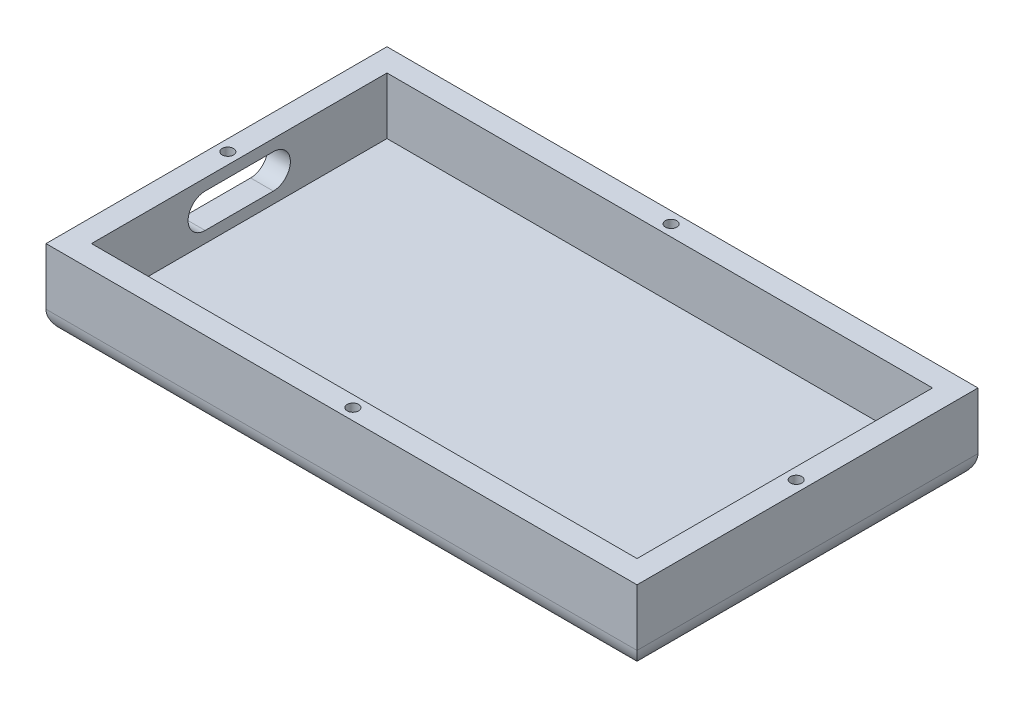
ISO-10303-21;
HEADER;
FILE_DESCRIPTION(('STEP AP214'),'2;1');
FILE_NAME('part.step','',(''),(''),'','','');
FILE_SCHEMA(('AUTOMOTIVE_DESIGN { 1 0 10303 214 1 1 1 1 }'));
ENDSEC;
DATA;
#1=APPLICATION_CONTEXT('core data for automotive mechanical design processes');
#2=APPLICATION_PROTOCOL_DEFINITION('international standard','automotive_design',2000,#1);
#3=PRODUCT_CONTEXT('',#1,'mechanical');
#4=PRODUCT('Part','Part','',(#3));
#5=PRODUCT_RELATED_PRODUCT_CATEGORY('part','',(#4));
#6=PRODUCT_DEFINITION_FORMATION('','',#4);
#7=PRODUCT_DEFINITION_CONTEXT('part definition',#1,'design');
#8=PRODUCT_DEFINITION('design','',#6,#7);
#9=PRODUCT_DEFINITION_SHAPE('','',#8);
#10=(LENGTH_UNIT() NAMED_UNIT(*) SI_UNIT(.MILLI.,.METRE.));
#11=(NAMED_UNIT(*) PLANE_ANGLE_UNIT() SI_UNIT($,.RADIAN.));
#12=(NAMED_UNIT(*) SI_UNIT($,.STERADIAN.) SOLID_ANGLE_UNIT());
#13=UNCERTAINTY_MEASURE_WITH_UNIT(LENGTH_MEASURE(1.E-05),#10,'distance_accuracy_value','');
#14=(GEOMETRIC_REPRESENTATION_CONTEXT(3) GLOBAL_UNCERTAINTY_ASSIGNED_CONTEXT((#13)) GLOBAL_UNIT_ASSIGNED_CONTEXT((#10,
#11,#12)) REPRESENTATION_CONTEXT('',''));
#15=CARTESIAN_POINT('',(0.,0.,0.));
#16=DIRECTION('',(0.,0.,1.));
#17=DIRECTION('',(1.,0.,0.));
#18=AXIS2_PLACEMENT_3D('',#15,#16,#17);
#19=CARTESIAN_POINT('',(0.,17.78,0.));
#20=DIRECTION('',(1.,0.,0.));
#21=DIRECTION('',(0.,0.,-1.));
#22=AXIS2_PLACEMENT_3D('',#19,#20,#21);
#23=PLANE('',#22);
#24=DIRECTION('',(0.,0.,1.));
#25=VECTOR('',#24,1.);
#26=CARTESIAN_POINT('',(0.,3.81,-22.86));
#27=LINE('',#26,#25);
#28=CARTESIAN_POINT('',(0.,3.81,-22.86));
#29=VERTEX_POINT('',#28);
#30=CARTESIAN_POINT('',(0.,3.81,-15.24));
#31=VERTEX_POINT('',#30);
#32=EDGE_CURVE('E198',#29,#31,#27,.T.);
#33=ORIENTED_EDGE('',*,*,#32,.F.);
#34=CARTESIAN_POINT('',(0.,5.715,-22.86));
#35=DIRECTION('',(-1.,0.,0.));
#36=DIRECTION('',(0.,0.,1.));
#37=AXIS2_PLACEMENT_3D('',#34,#35,#36);
#38=CIRCLE('',#37,1.905);
#39=CARTESIAN_POINT('',(0.,7.62,-22.86));
#40=VERTEX_POINT('',#39);
#41=EDGE_CURVE('E168',#40,#29,#38,.T.);
#42=ORIENTED_EDGE('',*,*,#41,.F.);
#43=DIRECTION('',(0.,0.,-1.));
#44=VECTOR('',#43,1.);
#45=CARTESIAN_POINT('',(0.,7.62,-22.86));
#46=LINE('',#45,#44);
#47=CARTESIAN_POINT('',(0.,7.62,-15.24));
#48=VERTEX_POINT('',#47);
#49=EDGE_CURVE('E186',#48,#40,#46,.T.);
#50=ORIENTED_EDGE('',*,*,#49,.F.);
#51=CARTESIAN_POINT('',(0.,5.715,-15.24));
#52=DIRECTION('',(-1.,0.,0.));
#53=DIRECTION('',(0.,0.,1.));
#54=AXIS2_PLACEMENT_3D('',#51,#52,#53);
#55=CIRCLE('',#54,1.905);
#56=EDGE_CURVE('E189',#31,#48,#55,.T.);
#57=ORIENTED_EDGE('',*,*,#56,.F.);
#58=EDGE_LOOP('',(#33,#42,#50,#57));
#59=FACE_BOUND('',#58,.T.);
#60=DIRECTION('',(0.,-1.,0.));
#61=VECTOR('',#60,1.);
#62=CARTESIAN_POINT('',(0.,17.78,-38.1));
#63=LINE('',#62,#61);
#64=CARTESIAN_POINT('',(0.,8.89,-38.1));
#65=VERTEX_POINT('',#64);
#66=CARTESIAN_POINT('',(0.,2.54,-38.1));
#67=VERTEX_POINT('',#66);
#68=EDGE_CURVE('E264',#65,#67,#63,.T.);
#69=ORIENTED_EDGE('',*,*,#68,.T.);
#70=DIRECTION('',(0.,0.,1.));
#71=VECTOR('',#70,1.);
#72=CARTESIAN_POINT('',(0.,2.54,0.));
#73=LINE('',#72,#71);
#74=CARTESIAN_POINT('',(0.,2.54,0.));
#75=VERTEX_POINT('',#74);
#76=EDGE_CURVE('E12',#67,#75,#73,.T.);
#77=ORIENTED_EDGE('',*,*,#76,.T.);
#78=DIRECTION('',(0.,-1.,0.));
#79=VECTOR('',#78,1.);
#80=CARTESIAN_POINT('',(0.,17.78,0.));
#81=LINE('',#80,#79);
#82=CARTESIAN_POINT('',(0.,8.89,0.));
#83=VERTEX_POINT('',#82);
#84=EDGE_CURVE('E278',#83,#75,#81,.T.);
#85=ORIENTED_EDGE('',*,*,#84,.F.);
#86=DIRECTION('',(0.,0.,-1.));
#87=VECTOR('',#86,1.);
#88=CARTESIAN_POINT('',(0.,8.89,0.));
#89=LINE('',#88,#87);
#90=EDGE_CURVE('E230',#83,#65,#89,.T.);
#91=ORIENTED_EDGE('',*,*,#90,.T.);
#92=EDGE_LOOP('',(#69,#77,#85,#91));
#93=FACE_BOUND('',#92,.T.);
#94=ADVANCED_FACE('F57',(#59,#93),#23,.F.);
#95=CARTESIAN_POINT('',(0.,17.78,0.));
#96=DIRECTION('',(0.,0.,-1.));
#97=DIRECTION('',(-1.,0.,0.));
#98=AXIS2_PLACEMENT_3D('',#95,#96,#97);
#99=PLANE('',#98);
#100=ORIENTED_EDGE('',*,*,#84,.T.);
#101=DIRECTION('',(1.,0.,0.));
#102=VECTOR('',#101,1.);
#103=CARTESIAN_POINT('',(66.04,2.54,0.));
#104=LINE('',#103,#102);
#105=CARTESIAN_POINT('',(66.04,2.54,0.));
#106=VERTEX_POINT('',#105);
#107=EDGE_CURVE('E284',#75,#106,#104,.T.);
#108=ORIENTED_EDGE('',*,*,#107,.T.);
#109=DIRECTION('',(0.,-1.,0.));
#110=VECTOR('',#109,1.);
#111=CARTESIAN_POINT('',(66.04,17.78,0.));
#112=LINE('',#111,#110);
#113=CARTESIAN_POINT('',(66.04,8.89,0.));
#114=VERTEX_POINT('',#113);
#115=EDGE_CURVE('E276',#114,#106,#112,.T.);
#116=ORIENTED_EDGE('',*,*,#115,.F.);
#117=DIRECTION('',(1.,0.,0.));
#118=VECTOR('',#117,1.);
#119=CARTESIAN_POINT('',(0.,8.89,0.));
#120=LINE('',#119,#118);
#121=EDGE_CURVE('E233',#83,#114,#120,.T.);
#122=ORIENTED_EDGE('',*,*,#121,.F.);
#123=EDGE_LOOP('',(#100,#108,#116,#122));
#124=FACE_BOUND('',#123,.T.);
#125=ADVANCED_FACE('F328',(#124),#99,.F.);
#126=CARTESIAN_POINT('',(66.04,17.78,0.));
#127=DIRECTION('',(-1.,0.,0.));
#128=DIRECTION('',(0.,0.,1.));
#129=AXIS2_PLACEMENT_3D('',#126,#127,#128);
#130=PLANE('',#129);
#131=ORIENTED_EDGE('',*,*,#115,.T.);
#132=DIRECTION('',(0.,0.,-1.));
#133=VECTOR('',#132,1.);
#134=CARTESIAN_POINT('',(66.04,2.54,-38.1));
#135=LINE('',#134,#133);
#136=CARTESIAN_POINT('',(66.04,2.54,-38.1));
#137=VERTEX_POINT('',#136);
#138=EDGE_CURVE('E81',#106,#137,#135,.T.);
#139=ORIENTED_EDGE('',*,*,#138,.T.);
#140=DIRECTION('',(0.,-1.,0.));
#141=VECTOR('',#140,1.);
#142=CARTESIAN_POINT('',(66.04,17.78,-38.1));
#143=LINE('',#142,#141);
#144=CARTESIAN_POINT('',(66.04,8.89,-38.1));
#145=VERTEX_POINT('',#144);
#146=EDGE_CURVE('E274',#145,#137,#143,.T.);
#147=ORIENTED_EDGE('',*,*,#146,.F.);
#148=DIRECTION('',(0.,0.,-1.));
#149=VECTOR('',#148,1.);
#150=CARTESIAN_POINT('',(66.04,8.89,0.));
#151=LINE('',#150,#149);
#152=EDGE_CURVE('E211',#114,#145,#151,.T.);
#153=ORIENTED_EDGE('',*,*,#152,.F.);
#154=EDGE_LOOP('',(#131,#139,#147,#153));
#155=FACE_BOUND('',#154,.T.);
#156=ADVANCED_FACE('F332',(#155),#130,.F.);
#157=CARTESIAN_POINT('',(0.,17.78,-38.1));
#158=DIRECTION('',(0.,0.,1.));
#159=DIRECTION('',(1.,0.,0.));
#160=AXIS2_PLACEMENT_3D('',#157,#158,#159);
#161=PLANE('',#160);
#162=ORIENTED_EDGE('',*,*,#146,.T.);
#163=DIRECTION('',(-1.,0.,0.));
#164=VECTOR('',#163,1.);
#165=CARTESIAN_POINT('',(0.,2.54,-38.1));
#166=LINE('',#165,#164);
#167=EDGE_CURVE('E66',#137,#67,#166,.T.);
#168=ORIENTED_EDGE('',*,*,#167,.T.);
#169=ORIENTED_EDGE('',*,*,#68,.F.);
#170=DIRECTION('',(1.,0.,0.));
#171=VECTOR('',#170,1.);
#172=CARTESIAN_POINT('',(0.,8.89,-38.1));
#173=LINE('',#172,#171);
#174=EDGE_CURVE('E235',#65,#145,#173,.T.);
#175=ORIENTED_EDGE('',*,*,#174,.T.);
#176=EDGE_LOOP('',(#162,#168,#169,#175));
#177=FACE_BOUND('',#176,.T.);
#178=ADVANCED_FACE('F336',(#177),#161,.F.);
#179=CARTESIAN_POINT('',(0.,0.,0.));
#180=DIRECTION('',(0.,-1.,0.));
#181=DIRECTION('',(0.,0.,-1.));
#182=AXIS2_PLACEMENT_3D('',#179,#180,#181);
#183=PLANE('',#182);
#184=CARTESIAN_POINT('',(33.02,0.,-30.48));
#185=DIRECTION('',(0.,-1.,0.));
#186=DIRECTION('',(0.,0.,-1.));
#187=AXIS2_PLACEMENT_3D('',#184,#185,#186);
#188=CIRCLE('',#187,1.5875);
#189=CARTESIAN_POINT('',(33.02,0.,-32.0675));
#190=VERTEX_POINT('',#189);
#191=EDGE_CURVE('E192',#190,#190,#188,.T.);
#192=ORIENTED_EDGE('',*,*,#191,.F.);
#193=EDGE_LOOP('',(#192));
#194=FACE_BOUND('',#193,.T.);
#195=DIRECTION('',(0.,0.,-1.));
#196=VECTOR('',#195,1.);
#197=CARTESIAN_POINT('',(63.5,0.,0.));
#198=LINE('',#197,#196);
#199=CARTESIAN_POINT('',(63.5,0.,-35.56));
#200=VERTEX_POINT('',#199);
#201=CARTESIAN_POINT('',(63.5,0.,-2.54));
#202=VERTEX_POINT('',#201);
#203=EDGE_CURVE('E293',#200,#202,#198,.F.);
#204=ORIENTED_EDGE('',*,*,#203,.T.);
#205=DIRECTION('',(1.,0.,0.));
#206=VECTOR('',#205,1.);
#207=CARTESIAN_POINT('',(0.,0.,-2.54));
#208=LINE('',#207,#206);
#209=CARTESIAN_POINT('',(2.54,0.,-2.54));
#210=VERTEX_POINT('',#209);
#211=EDGE_CURVE('E295',#202,#210,#208,.F.);
#212=ORIENTED_EDGE('',*,*,#211,.T.);
#213=DIRECTION('',(0.,0.,1.));
#214=VECTOR('',#213,1.);
#215=CARTESIAN_POINT('',(2.54,0.,-38.1));
#216=LINE('',#215,#214);
#217=CARTESIAN_POINT('',(2.54,0.,-35.56));
#218=VERTEX_POINT('',#217);
#219=EDGE_CURVE('E289',#210,#218,#216,.F.);
#220=ORIENTED_EDGE('',*,*,#219,.T.);
#221=DIRECTION('',(-1.,0.,0.));
#222=VECTOR('',#221,1.);
#223=CARTESIAN_POINT('',(66.04,0.,-35.56));
#224=LINE('',#223,#222);
#225=EDGE_CURVE('E291',#218,#200,#224,.F.);
#226=ORIENTED_EDGE('',*,*,#225,.T.);
#227=EDGE_LOOP('',(#204,#212,#220,#226));
#228=FACE_BOUND('',#227,.T.);
#229=ADVANCED_FACE('F319',(#194,#228),#183,.T.);
#230=CARTESIAN_POINT('',(0.,8.89,0.));
#231=DIRECTION('',(0.,-1.,0.));
#232=DIRECTION('',(0.,0.,-1.));
#233=AXIS2_PLACEMENT_3D('',#230,#231,#232);
#234=PLANE('',#233);
#235=CARTESIAN_POINT('',(33.02,8.89,-36.83));
#236=DIRECTION('',(0.,1.,0.));
#237=DIRECTION('',(0.,0.,1.));
#238=AXIS2_PLACEMENT_3D('',#235,#236,#237);
#239=CIRCLE('',#238,0.634999999999996);
#240=CARTESIAN_POINT('',(33.02,8.89,-36.195));
#241=VERTEX_POINT('',#240);
#242=EDGE_CURVE('E212',#241,#241,#239,.T.);
#243=ORIENTED_EDGE('',*,*,#242,.F.);
#244=EDGE_LOOP('',(#243));
#245=FACE_BOUND('',#244,.T.);
#246=CARTESIAN_POINT('',(33.02,8.89,-1.27));
#247=DIRECTION('',(0.,1.,0.));
#248=DIRECTION('',(0.,0.,1.));
#249=AXIS2_PLACEMENT_3D('',#246,#247,#248);
#250=CIRCLE('',#249,0.634999999999995);
#251=CARTESIAN_POINT('',(33.02,8.89,-0.635000000000005));
#252=VERTEX_POINT('',#251);
#253=EDGE_CURVE('E218',#252,#252,#250,.T.);
#254=ORIENTED_EDGE('',*,*,#253,.F.);
#255=EDGE_LOOP('',(#254));
#256=FACE_BOUND('',#255,.T.);
#257=CARTESIAN_POINT('',(1.27,8.89,-19.05));
#258=DIRECTION('',(0.,1.,0.));
#259=DIRECTION('',(0.,0.,1.));
#260=AXIS2_PLACEMENT_3D('',#257,#258,#259);
#261=CIRCLE('',#260,0.634999999999999);
#262=CARTESIAN_POINT('',(1.27,8.89,-18.415));
#263=VERTEX_POINT('',#262);
#264=EDGE_CURVE('E221',#263,#263,#261,.T.);
#265=ORIENTED_EDGE('',*,*,#264,.F.);
#266=EDGE_LOOP('',(#265));
#267=FACE_BOUND('',#266,.T.);
#268=CARTESIAN_POINT('',(64.77,8.89,-19.05));
#269=DIRECTION('',(0.,1.,0.));
#270=DIRECTION('',(0.,0.,1.));
#271=AXIS2_PLACEMENT_3D('',#268,#269,#270);
#272=CIRCLE('',#271,0.635000000000002);
#273=CARTESIAN_POINT('',(64.77,8.89,-18.415));
#274=VERTEX_POINT('',#273);
#275=EDGE_CURVE('E227',#274,#274,#272,.T.);
#276=ORIENTED_EDGE('',*,*,#275,.F.);
#277=EDGE_LOOP('',(#276));
#278=FACE_BOUND('',#277,.T.);
#279=ORIENTED_EDGE('',*,*,#152,.T.);
#280=ORIENTED_EDGE('',*,*,#174,.F.);
#281=ORIENTED_EDGE('',*,*,#90,.F.);
#282=ORIENTED_EDGE('',*,*,#121,.T.);
#283=EDGE_LOOP('',(#279,#280,#281,#282));
#284=FACE_BOUND('',#283,.T.);
#285=DIRECTION('',(-1.,0.,0.));
#286=VECTOR('',#285,1.);
#287=CARTESIAN_POINT('',(2.54,8.89,-35.56));
#288=LINE('',#287,#286);
#289=CARTESIAN_POINT('',(63.5,8.89,-35.56));
#290=VERTEX_POINT('',#289);
#291=CARTESIAN_POINT('',(2.54,8.89,-35.56));
#292=VERTEX_POINT('',#291);
#293=EDGE_CURVE('E242',#290,#292,#288,.T.);
#294=ORIENTED_EDGE('',*,*,#293,.F.);
#295=DIRECTION('',(0.,0.,-1.));
#296=VECTOR('',#295,1.);
#297=CARTESIAN_POINT('',(63.5,8.89,-35.56));
#298=LINE('',#297,#296);
#299=CARTESIAN_POINT('',(63.5,8.89,-2.54));
#300=VERTEX_POINT('',#299);
#301=EDGE_CURVE('E238',#300,#290,#298,.T.);
#302=ORIENTED_EDGE('',*,*,#301,.F.);
#303=DIRECTION('',(1.,0.,0.));
#304=VECTOR('',#303,1.);
#305=CARTESIAN_POINT('',(2.54,8.89,-2.54));
#306=LINE('',#305,#304);
#307=CARTESIAN_POINT('',(2.54,8.89,-2.54));
#308=VERTEX_POINT('',#307);
#309=EDGE_CURVE('E281',#308,#300,#306,.T.);
#310=ORIENTED_EDGE('',*,*,#309,.F.);
#311=DIRECTION('',(0.,0.,1.));
#312=VECTOR('',#311,1.);
#313=CARTESIAN_POINT('',(2.54,8.89,-35.56));
#314=LINE('',#313,#312);
#315=EDGE_CURVE('E245',#292,#308,#314,.T.);
#316=ORIENTED_EDGE('',*,*,#315,.F.);
#317=EDGE_LOOP('',(#294,#302,#310,#316));
#318=FACE_BOUND('',#317,.T.);
#319=ADVANCED_FACE('F334',(#245,#256,#267,#278,#284,#318),#234,.F.);
#320=CARTESIAN_POINT('',(0.,2.54,0.));
#321=DIRECTION('',(0.,1.,0.));
#322=DIRECTION('',(0.,0.,1.));
#323=AXIS2_PLACEMENT_3D('',#320,#321,#322);
#324=PLANE('',#323);
#325=DIRECTION('',(0.,0.,1.));
#326=VECTOR('',#325,1.);
#327=CARTESIAN_POINT('',(2.54,2.54,-35.56));
#328=LINE('',#327,#326);
#329=CARTESIAN_POINT('',(2.54,2.54,-35.56));
#330=VERTEX_POINT('',#329);
#331=CARTESIAN_POINT('',(2.54,2.54,-2.54));
#332=VERTEX_POINT('',#331);
#333=EDGE_CURVE('E248',#330,#332,#328,.T.);
#334=ORIENTED_EDGE('',*,*,#333,.T.);
#335=DIRECTION('',(1.,0.,0.));
#336=VECTOR('',#335,1.);
#337=CARTESIAN_POINT('',(2.54,2.54,-2.54));
#338=LINE('',#337,#336);
#339=CARTESIAN_POINT('',(63.5,2.54,-2.54));
#340=VERTEX_POINT('',#339);
#341=EDGE_CURVE('E251',#332,#340,#338,.T.);
#342=ORIENTED_EDGE('',*,*,#341,.T.);
#343=DIRECTION('',(0.,0.,-1.));
#344=VECTOR('',#343,1.);
#345=CARTESIAN_POINT('',(63.5,2.54,-35.56));
#346=LINE('',#345,#344);
#347=CARTESIAN_POINT('',(63.5,2.54,-35.56));
#348=VERTEX_POINT('',#347);
#349=EDGE_CURVE('E254',#340,#348,#346,.T.);
#350=ORIENTED_EDGE('',*,*,#349,.T.);
#351=DIRECTION('',(-1.,0.,0.));
#352=VECTOR('',#351,1.);
#353=CARTESIAN_POINT('',(2.54,2.54,-35.56));
#354=LINE('',#353,#352);
#355=EDGE_CURVE('E257',#348,#330,#354,.T.);
#356=ORIENTED_EDGE('',*,*,#355,.T.);
#357=EDGE_LOOP('',(#334,#342,#350,#356));
#358=FACE_BOUND('',#357,.T.);
#359=ADVANCED_FACE('F383',(#358),#324,.T.);
#360=CARTESIAN_POINT('',(2.54,2.54,-2.54));
#361=DIRECTION('',(0.,0.,1.));
#362=DIRECTION('',(1.,0.,0.));
#363=AXIS2_PLACEMENT_3D('',#360,#361,#362);
#364=PLANE('',#363);
#365=DIRECTION('',(0.,1.,0.));
#366=VECTOR('',#365,1.);
#367=CARTESIAN_POINT('',(2.54,2.54,-2.54));
#368=LINE('',#367,#366);
#369=EDGE_CURVE('E260',#332,#308,#368,.T.);
#370=ORIENTED_EDGE('',*,*,#369,.T.);
#371=ORIENTED_EDGE('',*,*,#309,.T.);
#372=DIRECTION('',(0.,1.,0.));
#373=VECTOR('',#372,1.);
#374=CARTESIAN_POINT('',(63.5,2.54,-2.54));
#375=LINE('',#374,#373);
#376=EDGE_CURVE('E268',#340,#300,#375,.T.);
#377=ORIENTED_EDGE('',*,*,#376,.F.);
#378=ORIENTED_EDGE('',*,*,#341,.F.);
#379=EDGE_LOOP('',(#370,#371,#377,#378));
#380=FACE_BOUND('',#379,.T.);
#381=ADVANCED_FACE('F387',(#380),#364,.F.);
#382=CARTESIAN_POINT('',(63.5,2.54,-35.56));
#383=DIRECTION('',(1.,0.,0.));
#384=DIRECTION('',(0.,0.,-1.));
#385=AXIS2_PLACEMENT_3D('',#382,#383,#384);
#386=PLANE('',#385);
#387=ORIENTED_EDGE('',*,*,#376,.T.);
#388=ORIENTED_EDGE('',*,*,#301,.T.);
#389=DIRECTION('',(0.,1.,0.));
#390=VECTOR('',#389,1.);
#391=CARTESIAN_POINT('',(63.5,2.54,-35.56));
#392=LINE('',#391,#390);
#393=EDGE_CURVE('E265',#348,#290,#392,.T.);
#394=ORIENTED_EDGE('',*,*,#393,.F.);
#395=ORIENTED_EDGE('',*,*,#349,.F.);
#396=EDGE_LOOP('',(#387,#388,#394,#395));
#397=FACE_BOUND('',#396,.T.);
#398=ADVANCED_FACE('F392',(#397),#386,.F.);
#399=CARTESIAN_POINT('',(2.54,2.54,-35.56));
#400=DIRECTION('',(0.,0.,-1.));
#401=DIRECTION('',(-1.,0.,0.));
#402=AXIS2_PLACEMENT_3D('',#399,#400,#401);
#403=PLANE('',#402);
#404=ORIENTED_EDGE('',*,*,#393,.T.);
#405=ORIENTED_EDGE('',*,*,#293,.T.);
#406=DIRECTION('',(0.,1.,0.));
#407=VECTOR('',#406,1.);
#408=CARTESIAN_POINT('',(2.54,2.54,-35.56));
#409=LINE('',#408,#407);
#410=EDGE_CURVE('E261',#330,#292,#409,.T.);
#411=ORIENTED_EDGE('',*,*,#410,.F.);
#412=ORIENTED_EDGE('',*,*,#355,.F.);
#413=EDGE_LOOP('',(#404,#405,#411,#412));
#414=FACE_BOUND('',#413,.T.);
#415=ADVANCED_FACE('F389',(#414),#403,.F.);
#416=CARTESIAN_POINT('',(2.54,2.54,-35.56));
#417=DIRECTION('',(-1.,0.,0.));
#418=DIRECTION('',(0.,0.,1.));
#419=AXIS2_PLACEMENT_3D('',#416,#417,#418);
#420=PLANE('',#419);
#421=DIRECTION('',(0.,0.,-1.));
#422=VECTOR('',#421,1.);
#423=CARTESIAN_POINT('',(2.54,7.62,-22.86));
#424=LINE('',#423,#422);
#425=CARTESIAN_POINT('',(2.54,7.62,-15.24));
#426=VERTEX_POINT('',#425);
#427=CARTESIAN_POINT('',(2.54,7.62,-22.86));
#428=VERTEX_POINT('',#427);
#429=EDGE_CURVE('E173',#426,#428,#424,.T.);
#430=ORIENTED_EDGE('',*,*,#429,.T.);
#431=CARTESIAN_POINT('',(2.54,5.715,-22.86));
#432=DIRECTION('',(-1.,0.,0.));
#433=DIRECTION('',(0.,0.,1.));
#434=AXIS2_PLACEMENT_3D('',#431,#432,#433);
#435=CIRCLE('',#434,1.905);
#436=CARTESIAN_POINT('',(2.54,3.81,-22.86));
#437=VERTEX_POINT('',#436);
#438=EDGE_CURVE('E165',#428,#437,#435,.T.);
#439=ORIENTED_EDGE('',*,*,#438,.T.);
#440=DIRECTION('',(0.,0.,1.));
#441=VECTOR('',#440,1.);
#442=CARTESIAN_POINT('',(2.54,3.81,-22.86));
#443=LINE('',#442,#441);
#444=CARTESIAN_POINT('',(2.54,3.81,-15.24));
#445=VERTEX_POINT('',#444);
#446=EDGE_CURVE('E177',#437,#445,#443,.T.);
#447=ORIENTED_EDGE('',*,*,#446,.T.);
#448=CARTESIAN_POINT('',(2.54,5.715,-15.24));
#449=DIRECTION('',(-1.,0.,0.));
#450=DIRECTION('',(0.,0.,1.));
#451=AXIS2_PLACEMENT_3D('',#448,#449,#450);
#452=CIRCLE('',#451,1.905);
#453=EDGE_CURVE('E181',#445,#426,#452,.T.);
#454=ORIENTED_EDGE('',*,*,#453,.T.);
#455=EDGE_LOOP('',(#430,#439,#447,#454));
#456=FACE_BOUND('',#455,.T.);
#457=ORIENTED_EDGE('',*,*,#410,.T.);
#458=ORIENTED_EDGE('',*,*,#315,.T.);
#459=ORIENTED_EDGE('',*,*,#369,.F.);
#460=ORIENTED_EDGE('',*,*,#333,.F.);
#461=EDGE_LOOP('',(#457,#458,#459,#460));
#462=FACE_BOUND('',#461,.T.);
#463=ADVANCED_FACE('F183',(#456,#462),#420,.F.);
#464=CARTESIAN_POINT('',(64.77,3.81,-19.05));
#465=DIRECTION('',(0.,1.,0.));
#466=DIRECTION('',(0.,0.,1.));
#467=AXIS2_PLACEMENT_3D('',#464,#465,#466);
#468=CYLINDRICAL_SURFACE('',#467,0.635000000000002);
#469=CARTESIAN_POINT('',(64.77,3.81,-19.05));
#470=DIRECTION('',(0.,1.,0.));
#471=DIRECTION('',(0.,0.,1.));
#472=AXIS2_PLACEMENT_3D('',#469,#470,#471);
#473=CIRCLE('',#472,0.635000000000002);
#474=CARTESIAN_POINT('',(64.77,3.81,-18.415));
#475=VERTEX_POINT('',#474);
#476=EDGE_CURVE('E224',#475,#475,#473,.T.);
#477=ORIENTED_EDGE('',*,*,#476,.F.);
#478=EDGE_LOOP('',(#477));
#479=FACE_BOUND('',#478,.T.);
#480=ORIENTED_EDGE('',*,*,#275,.T.);
#481=EDGE_LOOP('',(#480));
#482=FACE_BOUND('',#481,.T.);
#483=ADVANCED_FACE('F376',(#479,#482),#468,.F.);
#484=CARTESIAN_POINT('',(64.77,3.81,-19.05));
#485=DIRECTION('',(0.,1.,0.));
#486=DIRECTION('',(0.,0.,1.));
#487=AXIS2_PLACEMENT_3D('',#484,#485,#486);
#488=PLANE('',#487);
#489=ORIENTED_EDGE('',*,*,#476,.T.);
#490=EDGE_LOOP('',(#489));
#491=FACE_BOUND('',#490,.T.);
#492=ADVANCED_FACE('F372',(#491),#488,.T.);
#493=CARTESIAN_POINT('',(1.27,3.81,-19.05));
#494=DIRECTION('',(0.,1.,0.));
#495=DIRECTION('',(0.,0.,1.));
#496=AXIS2_PLACEMENT_3D('',#493,#494,#495);
#497=CYLINDRICAL_SURFACE('',#496,0.634999999999999);
#498=CARTESIAN_POINT('',(1.27,7.62,-19.05));
#499=DIRECTION('',(0.,1.,0.));
#500=DIRECTION('',(0.,0.,1.));
#501=AXIS2_PLACEMENT_3D('',#498,#499,#500);
#502=CIRCLE('',#501,0.634999999999999);
#503=CARTESIAN_POINT('',(1.27,7.62,-18.415));
#504=VERTEX_POINT('',#503);
#505=EDGE_CURVE('E204',#504,#504,#502,.F.);
#506=ORIENTED_EDGE('',*,*,#505,.T.);
#507=EDGE_LOOP('',(#506));
#508=FACE_BOUND('',#507,.T.);
#509=ORIENTED_EDGE('',*,*,#264,.T.);
#510=EDGE_LOOP('',(#509));
#511=FACE_BOUND('',#510,.T.);
#512=ADVANCED_FACE('F369',(#508,#511),#497,.F.);
#513=CARTESIAN_POINT('',(33.02,3.81,-1.27));
#514=DIRECTION('',(0.,1.,0.));
#515=DIRECTION('',(0.,0.,1.));
#516=AXIS2_PLACEMENT_3D('',#513,#514,#515);
#517=CYLINDRICAL_SURFACE('',#516,0.634999999999995);
#518=CARTESIAN_POINT('',(33.02,3.81,-1.27));
#519=DIRECTION('',(0.,1.,0.));
#520=DIRECTION('',(0.,0.,1.));
#521=AXIS2_PLACEMENT_3D('',#518,#519,#520);
#522=CIRCLE('',#521,0.634999999999995);
#523=CARTESIAN_POINT('',(33.02,3.81,-0.635000000000005));
#524=VERTEX_POINT('',#523);
#525=EDGE_CURVE('E215',#524,#524,#522,.T.);
#526=ORIENTED_EDGE('',*,*,#525,.F.);
#527=EDGE_LOOP('',(#526));
#528=FACE_BOUND('',#527,.T.);
#529=ORIENTED_EDGE('',*,*,#253,.T.);
#530=EDGE_LOOP('',(#529));
#531=FACE_BOUND('',#530,.T.);
#532=ADVANCED_FACE('F367',(#528,#531),#517,.F.);
#533=CARTESIAN_POINT('',(33.02,3.81,-1.27));
#534=DIRECTION('',(0.,1.,0.));
#535=DIRECTION('',(0.,0.,1.));
#536=AXIS2_PLACEMENT_3D('',#533,#534,#535);
#537=PLANE('',#536);
#538=ORIENTED_EDGE('',*,*,#525,.T.);
#539=EDGE_LOOP('',(#538));
#540=FACE_BOUND('',#539,.T.);
#541=ADVANCED_FACE('F476',(#540),#537,.T.);
#542=CARTESIAN_POINT('',(33.02,3.81,-36.83));
#543=DIRECTION('',(0.,1.,0.));
#544=DIRECTION('',(0.,0.,1.));
#545=AXIS2_PLACEMENT_3D('',#542,#543,#544);
#546=CYLINDRICAL_SURFACE('',#545,0.634999999999996);
#547=CARTESIAN_POINT('',(33.02,3.81,-36.83));
#548=DIRECTION('',(0.,1.,0.));
#549=DIRECTION('',(0.,0.,1.));
#550=AXIS2_PLACEMENT_3D('',#547,#548,#549);
#551=CIRCLE('',#550,0.634999999999996);
#552=CARTESIAN_POINT('',(33.02,3.81,-36.195));
#553=VERTEX_POINT('',#552);
#554=EDGE_CURVE('E208',#553,#553,#551,.T.);
#555=ORIENTED_EDGE('',*,*,#554,.F.);
#556=EDGE_LOOP('',(#555));
#557=FACE_BOUND('',#556,.T.);
#558=ORIENTED_EDGE('',*,*,#242,.T.);
#559=EDGE_LOOP('',(#558));
#560=FACE_BOUND('',#559,.T.);
#561=ADVANCED_FACE('F473',(#557,#560),#546,.F.);
#562=CARTESIAN_POINT('',(33.02,3.81,-36.83));
#563=DIRECTION('',(0.,1.,0.));
#564=DIRECTION('',(0.,0.,1.));
#565=AXIS2_PLACEMENT_3D('',#562,#563,#564);
#566=PLANE('',#565);
#567=ORIENTED_EDGE('',*,*,#554,.T.);
#568=EDGE_LOOP('',(#567));
#569=FACE_BOUND('',#568,.T.);
#570=ADVANCED_FACE('F466',(#569),#566,.T.);
#571=CARTESIAN_POINT('',(2.54,7.62,-22.86));
#572=DIRECTION('',(0.,1.,0.));
#573=DIRECTION('',(0.,0.,1.));
#574=AXIS2_PLACEMENT_3D('',#571,#572,#573);
#575=PLANE('',#574);
#576=ORIENTED_EDGE('',*,*,#49,.T.);
#577=DIRECTION('',(-1.,0.,0.));
#578=VECTOR('',#577,1.);
#579=CARTESIAN_POINT('',(2.54,7.62,-22.86));
#580=LINE('',#579,#578);
#581=EDGE_CURVE('E202',#428,#40,#580,.T.);
#582=ORIENTED_EDGE('',*,*,#581,.F.);
#583=ORIENTED_EDGE('',*,*,#429,.F.);
#584=DIRECTION('',(-1.,0.,0.));
#585=VECTOR('',#584,1.);
#586=CARTESIAN_POINT('',(2.54,7.62,-15.24));
#587=LINE('',#586,#585);
#588=EDGE_CURVE('E205',#426,#48,#587,.T.);
#589=ORIENTED_EDGE('',*,*,#588,.T.);
#590=EDGE_LOOP('',(#576,#582,#583,#589));
#591=FACE_BOUND('',#590,.T.);
#592=ORIENTED_EDGE('',*,*,#505,.F.);
#593=EDGE_LOOP('',(#592));
#594=FACE_BOUND('',#593,.T.);
#595=ADVANCED_FACE('F464',(#591,#594),#575,.F.);
#596=CARTESIAN_POINT('',(2.54,5.715,-22.86));
#597=DIRECTION('',(-1.,0.,0.));
#598=DIRECTION('',(0.,0.,1.));
#599=AXIS2_PLACEMENT_3D('',#596,#597,#598);
#600=CYLINDRICAL_SURFACE('',#599,1.905);
#601=ORIENTED_EDGE('',*,*,#41,.T.);
#602=DIRECTION('',(-1.,0.,0.));
#603=VECTOR('',#602,1.);
#604=CARTESIAN_POINT('',(2.54,3.81,-22.86));
#605=LINE('',#604,#603);
#606=EDGE_CURVE('E161',#437,#29,#605,.T.);
#607=ORIENTED_EDGE('',*,*,#606,.F.);
#608=ORIENTED_EDGE('',*,*,#438,.F.);
#609=ORIENTED_EDGE('',*,*,#581,.T.);
#610=EDGE_LOOP('',(#601,#607,#608,#609));
#611=FACE_BOUND('',#610,.T.);
#612=ADVANCED_FACE('F163',(#611),#600,.F.);
#613=CARTESIAN_POINT('',(2.54,5.715,-15.24));
#614=DIRECTION('',(-1.,0.,0.));
#615=DIRECTION('',(0.,0.,1.));
#616=AXIS2_PLACEMENT_3D('',#613,#614,#615);
#617=CYLINDRICAL_SURFACE('',#616,1.905);
#618=ORIENTED_EDGE('',*,*,#56,.T.);
#619=ORIENTED_EDGE('',*,*,#588,.F.);
#620=ORIENTED_EDGE('',*,*,#453,.F.);
#621=DIRECTION('',(-1.,0.,0.));
#622=VECTOR('',#621,1.);
#623=CARTESIAN_POINT('',(2.54,3.81,-15.24));
#624=LINE('',#623,#622);
#625=EDGE_CURVE('E172',#445,#31,#624,.T.);
#626=ORIENTED_EDGE('',*,*,#625,.T.);
#627=EDGE_LOOP('',(#618,#619,#620,#626));
#628=FACE_BOUND('',#627,.T.);
#629=ADVANCED_FACE('F359',(#628),#617,.F.);
#630=CARTESIAN_POINT('',(1.27,3.81,-19.05));
#631=DIRECTION('',(0.,1.,0.));
#632=DIRECTION('',(0.,0.,1.));
#633=AXIS2_PLACEMENT_3D('',#630,#631,#632);
#634=PLANE('',#633);
#635=ORIENTED_EDGE('',*,*,#32,.T.);
#636=ORIENTED_EDGE('',*,*,#625,.F.);
#637=ORIENTED_EDGE('',*,*,#446,.F.);
#638=ORIENTED_EDGE('',*,*,#606,.T.);
#639=EDGE_LOOP('',(#635,#636,#637,#638));
#640=FACE_BOUND('',#639,.T.);
#641=ADVANCED_FACE('F178',(#640),#634,.T.);
#642=CARTESIAN_POINT('',(0.,2.54,-35.56));
#643=DIRECTION('',(1.,0.,0.));
#644=DIRECTION('',(0.,0.,-1.));
#645=AXIS2_PLACEMENT_3D('',#642,#643,#644);
#646=CYLINDRICAL_SURFACE('',#645,2.54);
#647=CARTESIAN_POINT('',(63.5,2.54,-35.56));
#648=DIRECTION('',(0.707106781186547,0.,0.707106781186547));
#649=DIRECTION('',(0.707106781186547,0.,-0.707106781186547));
#650=AXIS2_PLACEMENT_3D('',#647,#648,#649);
#651=ELLIPSE('',#650,3.59210244842766,2.54);
#652=EDGE_CURVE('E304',#200,#137,#651,.T.);
#653=ORIENTED_EDGE('',*,*,#652,.F.);
#654=ORIENTED_EDGE('',*,*,#225,.F.);
#655=CARTESIAN_POINT('',(2.54,2.54,-35.56));
#656=DIRECTION('',(0.707106781186547,0.,-0.707106781186547));
#657=DIRECTION('',(-0.707106781186547,0.,-0.707106781186547));
#658=AXIS2_PLACEMENT_3D('',#655,#656,#657);
#659=ELLIPSE('',#658,3.59210244842766,2.54);
#660=EDGE_CURVE('E61',#67,#218,#659,.F.);
#661=ORIENTED_EDGE('',*,*,#660,.F.);
#662=ORIENTED_EDGE('',*,*,#167,.F.);
#663=EDGE_LOOP('',(#653,#654,#661,#662));
#664=FACE_BOUND('',#663,.T.);
#665=ADVANCED_FACE('F59',(#664),#646,.T.);
#666=CARTESIAN_POINT('',(2.54,2.54,0.));
#667=DIRECTION('',(0.,0.,-1.));
#668=DIRECTION('',(-1.,0.,0.));
#669=AXIS2_PLACEMENT_3D('',#666,#667,#668);
#670=CYLINDRICAL_SURFACE('',#669,2.54);
#671=ORIENTED_EDGE('',*,*,#660,.T.);
#672=ORIENTED_EDGE('',*,*,#219,.F.);
#673=CARTESIAN_POINT('',(2.54,2.54,-2.54));
#674=DIRECTION('',(-0.707106781186547,0.,-0.707106781186547));
#675=DIRECTION('',(0.707106781186547,0.,-0.707106781186547));
#676=AXIS2_PLACEMENT_3D('',#673,#674,#675);
#677=ELLIPSE('',#676,3.59210244842766,2.54);
#678=EDGE_CURVE('E302',#75,#210,#677,.F.);
#679=ORIENTED_EDGE('',*,*,#678,.F.);
#680=ORIENTED_EDGE('',*,*,#76,.F.);
#681=EDGE_LOOP('',(#671,#672,#679,#680));
#682=FACE_BOUND('',#681,.T.);
#683=ADVANCED_FACE('F314',(#682),#670,.T.);
#684=CARTESIAN_POINT('',(63.5,2.54,0.));
#685=DIRECTION('',(0.,0.,1.));
#686=DIRECTION('',(1.,0.,0.));
#687=AXIS2_PLACEMENT_3D('',#684,#685,#686);
#688=CYLINDRICAL_SURFACE('',#687,2.54);
#689=ORIENTED_EDGE('',*,*,#652,.T.);
#690=ORIENTED_EDGE('',*,*,#138,.F.);
#691=CARTESIAN_POINT('',(63.5,2.54,-2.54));
#692=DIRECTION('',(-0.707106781186547,0.,0.707106781186547));
#693=DIRECTION('',(0.707106781186547,0.,0.707106781186547));
#694=AXIS2_PLACEMENT_3D('',#691,#692,#693);
#695=ELLIPSE('',#694,3.59210244842766,2.54);
#696=EDGE_CURVE('E300',#202,#106,#695,.T.);
#697=ORIENTED_EDGE('',*,*,#696,.F.);
#698=ORIENTED_EDGE('',*,*,#203,.F.);
#699=EDGE_LOOP('',(#689,#690,#697,#698));
#700=FACE_BOUND('',#699,.T.);
#701=ADVANCED_FACE('F325',(#700),#688,.T.);
#702=CARTESIAN_POINT('',(0.,2.54,-2.54));
#703=DIRECTION('',(-1.,0.,0.));
#704=DIRECTION('',(0.,0.,1.));
#705=AXIS2_PLACEMENT_3D('',#702,#703,#704);
#706=CYLINDRICAL_SURFACE('',#705,2.54);
#707=ORIENTED_EDGE('',*,*,#678,.T.);
#708=ORIENTED_EDGE('',*,*,#211,.F.);
#709=ORIENTED_EDGE('',*,*,#696,.T.);
#710=ORIENTED_EDGE('',*,*,#107,.F.);
#711=EDGE_LOOP('',(#707,#708,#709,#710));
#712=FACE_BOUND('',#711,.T.);
#713=ADVANCED_FACE('F323',(#712),#706,.T.);
#714=CARTESIAN_POINT('',(33.02,1.27,-30.48));
#715=DIRECTION('',(0.,-1.,0.));
#716=DIRECTION('',(0.,0.,-1.));
#717=AXIS2_PLACEMENT_3D('',#714,#715,#716);
#718=CYLINDRICAL_SURFACE('',#717,1.5875);
#719=CARTESIAN_POINT('',(33.02,1.27,-30.48));
#720=DIRECTION('',(0.,-1.,0.));
#721=DIRECTION('',(0.,0.,-1.));
#722=AXIS2_PLACEMENT_3D('',#719,#720,#721);
#723=CIRCLE('',#722,1.5875);
#724=CARTESIAN_POINT('',(33.02,1.27,-32.0675));
#725=VERTEX_POINT('',#724);
#726=EDGE_CURVE('E303',#725,#725,#723,.T.);
#727=ORIENTED_EDGE('',*,*,#726,.F.);
#728=EDGE_LOOP('',(#727));
#729=FACE_BOUND('',#728,.T.);
#730=ORIENTED_EDGE('',*,*,#191,.T.);
#731=EDGE_LOOP('',(#730));
#732=FACE_BOUND('',#731,.T.);
#733=ADVANCED_FACE('F350',(#729,#732),#718,.F.);
#734=CARTESIAN_POINT('',(33.02,1.27,-30.48));
#735=DIRECTION('',(0.,-1.,0.));
#736=DIRECTION('',(0.,0.,-1.));
#737=AXIS2_PLACEMENT_3D('',#734,#735,#736);
#738=PLANE('',#737);
#739=ORIENTED_EDGE('',*,*,#726,.T.);
#740=EDGE_LOOP('',(#739));
#741=FACE_BOUND('',#740,.T.);
#742=ADVANCED_FACE('F448',(#741),#738,.T.);
#743=CLOSED_SHELL('',(#94,#125,#156,#178,#229,#319,#359,#381,#398,#415,#463,#483,#492,#512,#532,
#541,#561,#570,#595,#612,#629,#641,#665,#683,#701,#713,#733,#742));
#744=MANIFOLD_SOLID_BREP('B2',#743);
#745=ADVANCED_BREP_SHAPE_REPRESENTATION('',(#18,#744),#14);
#746=SHAPE_DEFINITION_REPRESENTATION(#9,#745);
ENDSEC;
END-ISO-10303-21;
